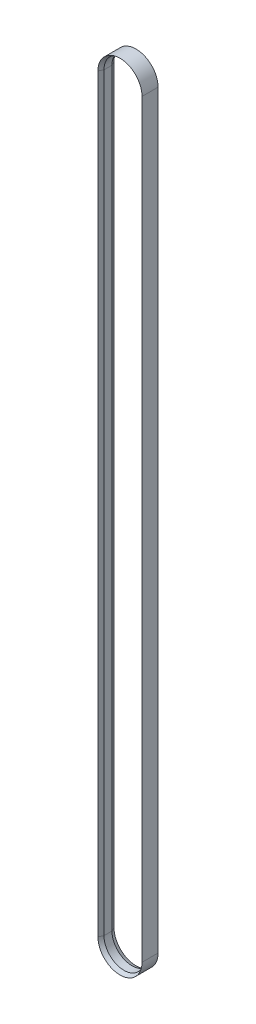
ISO-10303-21;
HEADER;
FILE_DESCRIPTION(('STEP AP214'),'2;1');
FILE_NAME('part.step','',(''),(''),'','','');
FILE_SCHEMA(('AUTOMOTIVE_DESIGN { 1 0 10303 214 1 1 1 1 }'));
ENDSEC;
DATA;
#1=APPLICATION_CONTEXT('core data for automotive mechanical design processes');
#2=APPLICATION_PROTOCOL_DEFINITION('international standard','automotive_design',2000,#1);
#3=PRODUCT_CONTEXT('',#1,'mechanical');
#4=PRODUCT('Part','Part','',(#3));
#5=PRODUCT_RELATED_PRODUCT_CATEGORY('part','',(#4));
#6=PRODUCT_DEFINITION_FORMATION('','',#4);
#7=PRODUCT_DEFINITION_CONTEXT('part definition',#1,'design');
#8=PRODUCT_DEFINITION('design','',#6,#7);
#9=PRODUCT_DEFINITION_SHAPE('','',#8);
#10=(LENGTH_UNIT() NAMED_UNIT(*) SI_UNIT(.MILLI.,.METRE.));
#11=(NAMED_UNIT(*) PLANE_ANGLE_UNIT() SI_UNIT($,.RADIAN.));
#12=(NAMED_UNIT(*) SI_UNIT($,.STERADIAN.) SOLID_ANGLE_UNIT());
#13=UNCERTAINTY_MEASURE_WITH_UNIT(LENGTH_MEASURE(1.E-05),#10,'distance_accuracy_value','');
#14=(GEOMETRIC_REPRESENTATION_CONTEXT(3) GLOBAL_UNCERTAINTY_ASSIGNED_CONTEXT((#13)) GLOBAL_UNIT_ASSIGNED_CONTEXT((#10,
#11,#12)) REPRESENTATION_CONTEXT('',''));
#15=CARTESIAN_POINT('',(0.,0.,0.));
#16=DIRECTION('',(0.,0.,1.));
#17=DIRECTION('',(1.,0.,0.));
#18=AXIS2_PLACEMENT_3D('',#15,#16,#17);
#19=CARTESIAN_POINT('',(25.0000000000219,-935.499999999727,-5.));
#20=DIRECTION('',(-1.,0.,0.));
#21=DIRECTION('',(0.,0.,1.));
#22=AXIS2_PLACEMENT_3D('',#19,#20,#21);
#23=PLANE('',#22);
#24=DIRECTION('',(0.,1.,0.));
#25=VECTOR('',#24,1.);
#26=CARTESIAN_POINT('',(25.0000000000219,-935.499999999727,-5.));
#27=LINE('',#26,#25);
#28=CARTESIAN_POINT('',(25.0000000000219,-935.499999999724,-5.));
#29=VERTEX_POINT('',#28);
#30=CARTESIAN_POINT('',(25.0000000000219,0.,-5.));
#31=VERTEX_POINT('',#30);
#32=EDGE_CURVE('E11',#29,#31,#27,.T.);
#33=ORIENTED_EDGE('',*,*,#32,.F.);
#34=DIRECTION('',(0.,0.,1.));
#35=VECTOR('',#34,1.);
#36=CARTESIAN_POINT('',(25.0000000000219,-935.499999999724,-5.));
#37=LINE('',#36,#35);
#38=CARTESIAN_POINT('',(25.0000000000219,-935.499999999724,5.));
#39=VERTEX_POINT('',#38);
#40=EDGE_CURVE('E42',#29,#39,#37,.T.);
#41=ORIENTED_EDGE('',*,*,#40,.T.);
#42=DIRECTION('',(0.,1.,0.));
#43=VECTOR('',#42,1.);
#44=CARTESIAN_POINT('',(25.0000000000219,-935.499999999727,5.));
#45=LINE('',#44,#43);
#46=CARTESIAN_POINT('',(25.0000000000219,0.,5.));
#47=VERTEX_POINT('',#46);
#48=EDGE_CURVE('E127',#39,#47,#45,.T.);
#49=ORIENTED_EDGE('',*,*,#48,.T.);
#50=DIRECTION('',(0.,0.,1.));
#51=VECTOR('',#50,1.);
#52=CARTESIAN_POINT('',(25.0000000000219,0.,-5.));
#53=LINE('',#52,#51);
#54=EDGE_CURVE('E130',#31,#47,#53,.T.);
#55=ORIENTED_EDGE('',*,*,#54,.F.);
#56=EDGE_LOOP('',(#33,#41,#49,#55));
#57=FACE_BOUND('',#56,.T.);
#58=ADVANCED_FACE('F39',(#57),#23,.T.);
#59=CARTESIAN_POINT('',(25.0000000000219,-935.499999999727,-5.));
#60=DIRECTION('',(-0.894427190999916,0.,-0.447213595499957));
#61=DIRECTION('',(-0.447213595499957,0.,0.894427190999916));
#62=AXIS2_PLACEMENT_3D('',#59,#60,#61);
#63=PLANE('',#62);
#64=DIRECTION('',(0.,1.,0.));
#65=VECTOR('',#64,1.);
#66=CARTESIAN_POINT('',(27.5000000000219,-935.499999999727,-10.));
#67=LINE('',#66,#65);
#68=CARTESIAN_POINT('',(27.5000000000219,-935.499999999724,-10.));
#69=VERTEX_POINT('',#68);
#70=CARTESIAN_POINT('',(27.5000000000219,0.,-10.));
#71=VERTEX_POINT('',#70);
#72=EDGE_CURVE('E47',#69,#71,#67,.T.);
#73=ORIENTED_EDGE('',*,*,#72,.F.);
#74=DIRECTION('',(-0.447213595499957,0.,0.894427190999916));
#75=VECTOR('',#74,1.);
#76=CARTESIAN_POINT('',(25.0000000000219,-935.499999999724,-5.));
#77=LINE('',#76,#75);
#78=EDGE_CURVE('E197',#69,#29,#77,.T.);
#79=ORIENTED_EDGE('',*,*,#78,.T.);
#80=ORIENTED_EDGE('',*,*,#32,.T.);
#81=DIRECTION('',(-0.447213595499957,0.,0.894427190999916));
#82=VECTOR('',#81,1.);
#83=CARTESIAN_POINT('',(25.0000000000219,0.,-5.));
#84=LINE('',#83,#82);
#85=EDGE_CURVE('E155',#71,#31,#84,.T.);
#86=ORIENTED_EDGE('',*,*,#85,.F.);
#87=EDGE_LOOP('',(#73,#79,#80,#86));
#88=FACE_BOUND('',#87,.T.);
#89=ADVANCED_FACE('F221',(#88),#63,.T.);
#90=CARTESIAN_POINT('',(27.5000000000219,-935.499999999727,-10.));
#91=DIRECTION('',(1.,0.,0.));
#92=DIRECTION('',(0.,0.,-1.));
#93=AXIS2_PLACEMENT_3D('',#90,#91,#92);
#94=PLANE('',#93);
#95=DIRECTION('',(0.,1.,0.));
#96=VECTOR('',#95,1.);
#97=CARTESIAN_POINT('',(27.5000000000219,-935.499999999727,10.));
#98=LINE('',#97,#96);
#99=CARTESIAN_POINT('',(27.5000000000219,-935.499999999724,10.));
#100=VERTEX_POINT('',#99);
#101=CARTESIAN_POINT('',(27.5000000000219,0.,10.));
#102=VERTEX_POINT('',#101);
#103=EDGE_CURVE('E136',#100,#102,#98,.T.);
#104=ORIENTED_EDGE('',*,*,#103,.F.);
#105=DIRECTION('',(0.,0.,-1.));
#106=VECTOR('',#105,1.);
#107=CARTESIAN_POINT('',(27.5000000000219,-935.499999999724,-10.));
#108=LINE('',#107,#106);
#109=EDGE_CURVE('E181',#100,#69,#108,.T.);
#110=ORIENTED_EDGE('',*,*,#109,.T.);
#111=ORIENTED_EDGE('',*,*,#72,.T.);
#112=DIRECTION('',(0.,0.,-1.));
#113=VECTOR('',#112,1.);
#114=CARTESIAN_POINT('',(27.5000000000219,0.,-10.));
#115=LINE('',#114,#113);
#116=EDGE_CURVE('E159',#102,#71,#115,.T.);
#117=ORIENTED_EDGE('',*,*,#116,.F.);
#118=EDGE_LOOP('',(#104,#110,#111,#117));
#119=FACE_BOUND('',#118,.T.);
#120=ADVANCED_FACE('F226',(#119),#94,.T.);
#121=CARTESIAN_POINT('',(-1.4210854715202E-11,-935.500000000075,0.));
#122=DIRECTION('',(0.,0.,1.));
#123=DIRECTION('',(1.,0.,0.));
#124=AXIS2_PLACEMENT_3D('',#121,#122,#123);
#125=CYLINDRICAL_SURFACE('',#124,25.0000000000361);
#126=ORIENTED_EDGE('',*,*,#40,.F.);
#127=CARTESIAN_POINT('',(-1.4210854715202E-11,-935.500000000075,-5.));
#128=DIRECTION('',(0.,0.,1.));
#129=DIRECTION('',(-1.,-1.40687461680297E-11,0.));
#130=AXIS2_PLACEMENT_3D('',#127,#128,#129);
#131=CIRCLE('',#130,25.0000000000361);
#132=CARTESIAN_POINT('',(-25.0000000000219,-935.500000000427,-5.));
#133=VERTEX_POINT('',#132);
#134=EDGE_CURVE('E83',#133,#29,#131,.T.);
#135=ORIENTED_EDGE('',*,*,#134,.F.);
#136=DIRECTION('',(0.,0.,1.));
#137=VECTOR('',#136,1.);
#138=CARTESIAN_POINT('',(-25.0000000000503,-935.500000000427,-5.));
#139=LINE('',#138,#137);
#140=CARTESIAN_POINT('',(-25.0000000000219,-935.500000000427,5.));
#141=VERTEX_POINT('',#140);
#142=EDGE_CURVE('E184',#133,#141,#139,.T.);
#143=ORIENTED_EDGE('',*,*,#142,.T.);
#144=CARTESIAN_POINT('',(-1.4210854715202E-11,-935.500000000075,5.));
#145=DIRECTION('',(0.,0.,1.));
#146=DIRECTION('',(-1.,-1.40687461680297E-11,0.));
#147=AXIS2_PLACEMENT_3D('',#144,#145,#146);
#148=CIRCLE('',#147,25.0000000000361);
#149=EDGE_CURVE('E179',#141,#39,#148,.T.);
#150=ORIENTED_EDGE('',*,*,#149,.T.);
#151=EDGE_LOOP('',(#126,#135,#143,#150));
#152=FACE_BOUND('',#151,.T.);
#153=ADVANCED_FACE('F210',(#152),#125,.F.);
#154=CARTESIAN_POINT('',(-1.4210854715202E-11,-935.500000000075,-10.));
#155=DIRECTION('',(0.,0.,-1.));
#156=DIRECTION('',(-1.,0.,0.));
#157=AXIS2_PLACEMENT_3D('',#154,#155,#156);
#158=CONICAL_SURFACE('',#157,27.5000000000361,0.463647609000805);
#159=ORIENTED_EDGE('',*,*,#134,.T.);
#160=ORIENTED_EDGE('',*,*,#78,.F.);
#161=CARTESIAN_POINT('',(-1.4210854715202E-11,-935.500000000075,-10.));
#162=DIRECTION('',(0.,0.,1.));
#163=DIRECTION('',(-1.,-1.2789769243665E-11,0.));
#164=AXIS2_PLACEMENT_3D('',#161,#162,#163);
#165=CIRCLE('',#164,27.5000000000361);
#166=CARTESIAN_POINT('',(-27.5000000000219,-935.500000000428,-10.));
#167=VERTEX_POINT('',#166);
#168=EDGE_CURVE('E92',#167,#69,#165,.T.);
#169=ORIENTED_EDGE('',*,*,#168,.F.);
#170=DIRECTION('',(0.447213595499957,0.,0.894427190999916));
#171=VECTOR('',#170,1.);
#172=CARTESIAN_POINT('',(-25.0000000000503,-935.500000000427,-5.));
#173=LINE('',#172,#171);
#174=EDGE_CURVE('E193',#167,#133,#173,.T.);
#175=ORIENTED_EDGE('',*,*,#174,.T.);
#176=EDGE_LOOP('',(#159,#160,#169,#175));
#177=FACE_BOUND('',#176,.T.);
#178=ADVANCED_FACE('F220',(#177),#158,.F.);
#179=CARTESIAN_POINT('',(-1.4210854715202E-11,-935.500000000075,0.));
#180=DIRECTION('',(0.,0.,1.));
#181=DIRECTION('',(1.,0.,0.));
#182=AXIS2_PLACEMENT_3D('',#179,#180,#181);
#183=CYLINDRICAL_SURFACE('',#182,27.5000000000361);
#184=ORIENTED_EDGE('',*,*,#168,.T.);
#185=ORIENTED_EDGE('',*,*,#109,.F.);
#186=CARTESIAN_POINT('',(-1.4210854715202E-11,-935.500000000075,10.));
#187=DIRECTION('',(0.,0.,1.));
#188=DIRECTION('',(-1.,-1.2789769243665E-11,0.));
#189=AXIS2_PLACEMENT_3D('',#186,#187,#188);
#190=CIRCLE('',#189,27.5000000000361);
#191=CARTESIAN_POINT('',(-27.5000000000219,-935.500000000428,10.));
#192=VERTEX_POINT('',#191);
#193=EDGE_CURVE('E100',#192,#100,#190,.T.);
#194=ORIENTED_EDGE('',*,*,#193,.F.);
#195=DIRECTION('',(0.,0.,-1.));
#196=VECTOR('',#195,1.);
#197=CARTESIAN_POINT('',(-27.5000000000503,-935.500000000428,-10.));
#198=LINE('',#197,#196);
#199=EDGE_CURVE('E173',#192,#167,#198,.T.);
#200=ORIENTED_EDGE('',*,*,#199,.T.);
#201=EDGE_LOOP('',(#184,#185,#194,#200));
#202=FACE_BOUND('',#201,.T.);
#203=ADVANCED_FACE('F227',(#202),#183,.T.);
#204=CARTESIAN_POINT('',(-1.4210854715202E-11,-935.500000000075,5.));
#205=DIRECTION('',(0.,0.,1.));
#206=DIRECTION('',(1.,0.,0.));
#207=AXIS2_PLACEMENT_3D('',#204,#205,#206);
#208=CONICAL_SURFACE('',#207,25.0000000000361,0.463647609000806);
#209=ORIENTED_EDGE('',*,*,#193,.T.);
#210=DIRECTION('',(0.447213595499958,0.,0.894427190999916));
#211=VECTOR('',#210,1.);
#212=CARTESIAN_POINT('',(27.5000000000219,-935.499999999724,10.));
#213=LINE('',#212,#211);
#214=EDGE_CURVE('E177',#39,#100,#213,.T.);
#215=ORIENTED_EDGE('',*,*,#214,.F.);
#216=ORIENTED_EDGE('',*,*,#149,.F.);
#217=DIRECTION('',(-0.447213595499958,0.,0.894427190999916));
#218=VECTOR('',#217,1.);
#219=CARTESIAN_POINT('',(-27.5000000000503,-935.500000000428,10.));
#220=LINE('',#219,#218);
#221=EDGE_CURVE('E168',#141,#192,#220,.T.);
#222=ORIENTED_EDGE('',*,*,#221,.T.);
#223=EDGE_LOOP('',(#209,#215,#216,#222));
#224=FACE_BOUND('',#223,.T.);
#225=ADVANCED_FACE('F228',(#224),#208,.F.);
#226=CARTESIAN_POINT('',(-25.0000000000219,-3.51136637481643E-12,-5.));
#227=DIRECTION('',(1.,0.,0.));
#228=DIRECTION('',(0.,0.,-1.));
#229=AXIS2_PLACEMENT_3D('',#226,#227,#228);
#230=PLANE('',#229);
#231=ORIENTED_EDGE('',*,*,#142,.F.);
#232=DIRECTION('',(0.,-1.,0.));
#233=VECTOR('',#232,1.);
#234=CARTESIAN_POINT('',(-25.0000000000219,-3.51136637481643E-12,-5.));
#235=LINE('',#234,#233);
#236=CARTESIAN_POINT('',(-25.0000000000503,0.,-5.));
#237=VERTEX_POINT('',#236);
#238=EDGE_CURVE('E203',#237,#133,#235,.T.);
#239=ORIENTED_EDGE('',*,*,#238,.F.);
#240=DIRECTION('',(0.,0.,1.));
#241=VECTOR('',#240,1.);
#242=CARTESIAN_POINT('',(-25.0000000000219,0.,-5.));
#243=LINE('',#242,#241);
#244=CARTESIAN_POINT('',(-25.0000000000503,0.,5.));
#245=VERTEX_POINT('',#244);
#246=EDGE_CURVE('E176',#237,#245,#243,.T.);
#247=ORIENTED_EDGE('',*,*,#246,.T.);
#248=DIRECTION('',(0.,-1.,0.));
#249=VECTOR('',#248,1.);
#250=CARTESIAN_POINT('',(-25.0000000000219,-3.51136637481643E-12,5.));
#251=LINE('',#250,#249);
#252=EDGE_CURVE('E171',#245,#141,#251,.T.);
#253=ORIENTED_EDGE('',*,*,#252,.T.);
#254=EDGE_LOOP('',(#231,#239,#247,#253));
#255=FACE_BOUND('',#254,.T.);
#256=ADVANCED_FACE('F215',(#255),#230,.T.);
#257=CARTESIAN_POINT('',(-25.0000000000219,-3.51136637481643E-12,-5.));
#258=DIRECTION('',(0.894427190999916,0.,-0.447213595499957));
#259=DIRECTION('',(-0.447213595499957,0.,-0.894427190999916));
#260=AXIS2_PLACEMENT_3D('',#257,#258,#259);
#261=PLANE('',#260);
#262=ORIENTED_EDGE('',*,*,#238,.T.);
#263=ORIENTED_EDGE('',*,*,#174,.F.);
#264=DIRECTION('',(0.,-1.,0.));
#265=VECTOR('',#264,1.);
#266=CARTESIAN_POINT('',(-27.5000000000219,-3.86250301229777E-12,-10.));
#267=LINE('',#266,#265);
#268=CARTESIAN_POINT('',(-27.5000000000503,0.,-10.));
#269=VERTEX_POINT('',#268);
#270=EDGE_CURVE('E112',#269,#167,#267,.T.);
#271=ORIENTED_EDGE('',*,*,#270,.F.);
#272=DIRECTION('',(0.447213595499957,0.,0.894427190999916));
#273=VECTOR('',#272,1.);
#274=CARTESIAN_POINT('',(-25.0000000000219,0.,-5.));
#275=LINE('',#274,#273);
#276=EDGE_CURVE('E190',#269,#237,#275,.T.);
#277=ORIENTED_EDGE('',*,*,#276,.T.);
#278=EDGE_LOOP('',(#262,#263,#271,#277));
#279=FACE_BOUND('',#278,.T.);
#280=ADVANCED_FACE('F219',(#279),#261,.T.);
#281=CARTESIAN_POINT('',(-27.5000000000219,-3.86250301229777E-12,-10.));
#282=DIRECTION('',(-1.,0.,0.));
#283=DIRECTION('',(0.,0.,1.));
#284=AXIS2_PLACEMENT_3D('',#281,#282,#283);
#285=PLANE('',#284);
#286=ORIENTED_EDGE('',*,*,#270,.T.);
#287=ORIENTED_EDGE('',*,*,#199,.F.);
#288=DIRECTION('',(0.,-1.,0.));
#289=VECTOR('',#288,1.);
#290=CARTESIAN_POINT('',(-27.5000000000219,-3.86250301229777E-12,10.));
#291=LINE('',#290,#289);
#292=CARTESIAN_POINT('',(-27.5000000000503,0.,10.));
#293=VERTEX_POINT('',#292);
#294=EDGE_CURVE('E118',#293,#192,#291,.T.);
#295=ORIENTED_EDGE('',*,*,#294,.F.);
#296=DIRECTION('',(0.,0.,-1.));
#297=VECTOR('',#296,1.);
#298=CARTESIAN_POINT('',(-27.5000000000219,0.,-10.));
#299=LINE('',#298,#297);
#300=EDGE_CURVE('E166',#293,#269,#299,.T.);
#301=ORIENTED_EDGE('',*,*,#300,.T.);
#302=EDGE_LOOP('',(#286,#287,#295,#301));
#303=FACE_BOUND('',#302,.T.);
#304=ADVANCED_FACE('F284',(#303),#285,.T.);
#305=CARTESIAN_POINT('',(-27.5000000000219,-3.86250301229777E-12,10.));
#306=DIRECTION('',(0.894427190999916,0.,0.447213595499958));
#307=DIRECTION('',(0.447213595499958,0.,-0.894427190999916));
#308=AXIS2_PLACEMENT_3D('',#305,#306,#307);
#309=PLANE('',#308);
#310=ORIENTED_EDGE('',*,*,#294,.T.);
#311=ORIENTED_EDGE('',*,*,#221,.F.);
#312=ORIENTED_EDGE('',*,*,#252,.F.);
#313=DIRECTION('',(-0.447213595499958,0.,0.894427190999916));
#314=VECTOR('',#313,1.);
#315=CARTESIAN_POINT('',(-27.5000000000219,0.,10.));
#316=LINE('',#315,#314);
#317=EDGE_CURVE('E147',#245,#293,#316,.T.);
#318=ORIENTED_EDGE('',*,*,#317,.T.);
#319=EDGE_LOOP('',(#310,#311,#312,#318));
#320=FACE_BOUND('',#319,.T.);
#321=ADVANCED_FACE('F213',(#320),#309,.T.);
#322=CARTESIAN_POINT('',(-1.4210854715202E-11,-3.5171865420125E-10,0.));
#323=DIRECTION('',(0.,0.,1.));
#324=DIRECTION('',(1.,0.,0.));
#325=AXIS2_PLACEMENT_3D('',#322,#323,#324);
#326=CYLINDRICAL_SURFACE('',#325,25.0000000000361);
#327=ORIENTED_EDGE('',*,*,#246,.F.);
#328=CARTESIAN_POINT('',(-1.4210854715202E-11,-3.5171865420125E-10,-5.));
#329=DIRECTION('',(0.,0.,1.));
#330=DIRECTION('',(1.,1.40687461680297E-11,0.));
#331=AXIS2_PLACEMENT_3D('',#328,#329,#330);
#332=CIRCLE('',#331,25.0000000000361);
#333=EDGE_CURVE('E154',#31,#237,#332,.T.);
#334=ORIENTED_EDGE('',*,*,#333,.F.);
#335=ORIENTED_EDGE('',*,*,#54,.T.);
#336=CARTESIAN_POINT('',(-1.4210854715202E-11,-3.5171865420125E-10,5.));
#337=DIRECTION('',(0.,0.,1.));
#338=DIRECTION('',(1.,1.40687461680297E-11,0.));
#339=AXIS2_PLACEMENT_3D('',#336,#337,#338);
#340=CIRCLE('',#339,25.0000000000361);
#341=EDGE_CURVE('E142',#47,#245,#340,.T.);
#342=ORIENTED_EDGE('',*,*,#341,.T.);
#343=EDGE_LOOP('',(#327,#334,#335,#342));
#344=FACE_BOUND('',#343,.T.);
#345=ADVANCED_FACE('F152',(#344),#326,.F.);
#346=CARTESIAN_POINT('',(-1.4210854715202E-11,-3.5171865420125E-10,-10.));
#347=DIRECTION('',(0.,0.,-1.));
#348=DIRECTION('',(-1.,0.,0.));
#349=AXIS2_PLACEMENT_3D('',#346,#347,#348);
#350=CONICAL_SURFACE('',#349,27.5000000000361,0.463647609000805);
#351=ORIENTED_EDGE('',*,*,#333,.T.);
#352=ORIENTED_EDGE('',*,*,#276,.F.);
#353=CARTESIAN_POINT('',(-1.4210854715202E-11,-3.5171865420125E-10,-10.));
#354=DIRECTION('',(0.,0.,1.));
#355=DIRECTION('',(1.,1.2789769243665E-11,0.));
#356=AXIS2_PLACEMENT_3D('',#353,#354,#355);
#357=CIRCLE('',#356,27.5000000000361);
#358=EDGE_CURVE('E187',#71,#269,#357,.T.);
#359=ORIENTED_EDGE('',*,*,#358,.F.);
#360=ORIENTED_EDGE('',*,*,#85,.T.);
#361=EDGE_LOOP('',(#351,#352,#359,#360));
#362=FACE_BOUND('',#361,.T.);
#363=ADVANCED_FACE('F217',(#362),#350,.F.);
#364=CARTESIAN_POINT('',(-1.4210854715202E-11,-3.5171865420125E-10,0.));
#365=DIRECTION('',(0.,0.,1.));
#366=DIRECTION('',(1.,0.,0.));
#367=AXIS2_PLACEMENT_3D('',#364,#365,#366);
#368=CYLINDRICAL_SURFACE('',#367,27.5000000000361);
#369=ORIENTED_EDGE('',*,*,#358,.T.);
#370=ORIENTED_EDGE('',*,*,#300,.F.);
#371=CARTESIAN_POINT('',(-1.4210854715202E-11,-3.5171865420125E-10,10.));
#372=DIRECTION('',(0.,0.,1.));
#373=DIRECTION('',(1.,1.2789769243665E-11,0.));
#374=AXIS2_PLACEMENT_3D('',#371,#372,#373);
#375=CIRCLE('',#374,27.5000000000361);
#376=EDGE_CURVE('E165',#102,#293,#375,.T.);
#377=ORIENTED_EDGE('',*,*,#376,.F.);
#378=ORIENTED_EDGE('',*,*,#116,.T.);
#379=EDGE_LOOP('',(#369,#370,#377,#378));
#380=FACE_BOUND('',#379,.T.);
#381=ADVANCED_FACE('F224',(#380),#368,.T.);
#382=CARTESIAN_POINT('',(-1.4210854715202E-11,-3.5171865420125E-10,5.));
#383=DIRECTION('',(0.,0.,1.));
#384=DIRECTION('',(1.,0.,0.));
#385=AXIS2_PLACEMENT_3D('',#382,#383,#384);
#386=CONICAL_SURFACE('',#385,25.0000000000361,0.463647609000806);
#387=ORIENTED_EDGE('',*,*,#376,.T.);
#388=ORIENTED_EDGE('',*,*,#317,.F.);
#389=ORIENTED_EDGE('',*,*,#341,.F.);
#390=DIRECTION('',(0.447213595499958,0.,0.894427190999916));
#391=VECTOR('',#390,1.);
#392=CARTESIAN_POINT('',(27.5000000000219,0.,10.));
#393=LINE('',#392,#391);
#394=EDGE_CURVE('E145',#47,#102,#393,.T.);
#395=ORIENTED_EDGE('',*,*,#394,.T.);
#396=EDGE_LOOP('',(#387,#388,#389,#395));
#397=FACE_BOUND('',#396,.T.);
#398=ADVANCED_FACE('F144',(#397),#386,.F.);
#399=CARTESIAN_POINT('',(27.5000000000219,-935.499999999727,10.));
#400=DIRECTION('',(-0.894427190999916,0.,0.447213595499958));
#401=DIRECTION('',(0.447213595499958,0.,0.894427190999916));
#402=AXIS2_PLACEMENT_3D('',#399,#400,#401);
#403=PLANE('',#402);
#404=ORIENTED_EDGE('',*,*,#214,.T.);
#405=ORIENTED_EDGE('',*,*,#103,.T.);
#406=ORIENTED_EDGE('',*,*,#394,.F.);
#407=ORIENTED_EDGE('',*,*,#48,.F.);
#408=EDGE_LOOP('',(#404,#405,#406,#407));
#409=FACE_BOUND('',#408,.T.);
#410=ADVANCED_FACE('F157',(#409),#403,.T.);
#411=CLOSED_SHELL('',(#58,#89,#120,#153,#178,#203,#225,#256,#280,#304,#321,#345,#363,#381,#398,#410));
#412=MANIFOLD_SOLID_BREP('B2',#411);
#413=ADVANCED_BREP_SHAPE_REPRESENTATION('',(#18,#412),#14);
#414=SHAPE_DEFINITION_REPRESENTATION(#9,#413);
ENDSEC;
END-ISO-10303-21;
